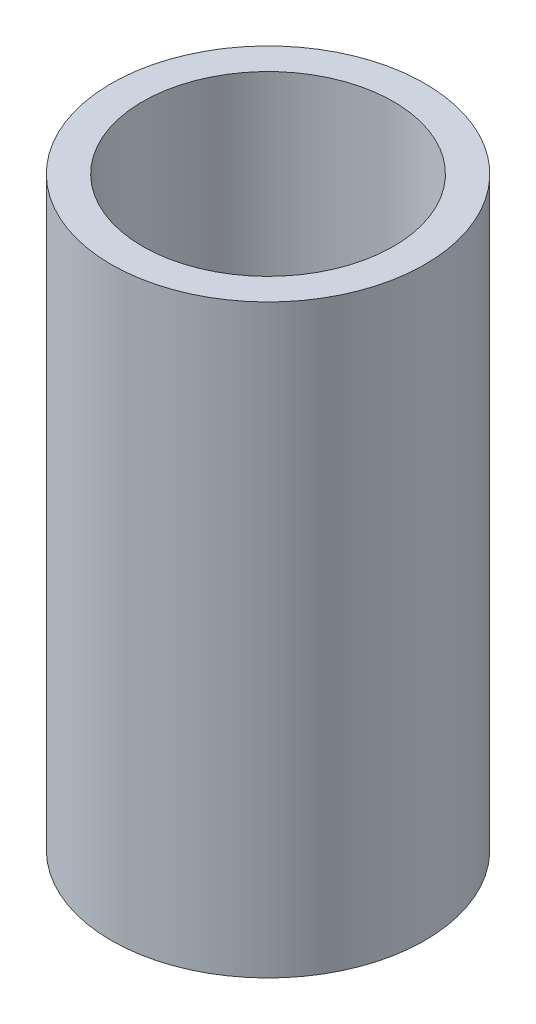
ISO-10303-21;
HEADER;
FILE_DESCRIPTION(('STEP AP214'),'2;1');
FILE_NAME('part.step','',(''),(''),'','','');
FILE_SCHEMA(('AUTOMOTIVE_DESIGN { 1 0 10303 214 1 1 1 1 }'));
ENDSEC;
DATA;
#1=APPLICATION_CONTEXT('core data for automotive mechanical design processes');
#2=APPLICATION_PROTOCOL_DEFINITION('international standard','automotive_design',2000,#1);
#3=PRODUCT_CONTEXT('',#1,'mechanical');
#4=PRODUCT('Part','Part','',(#3));
#5=PRODUCT_RELATED_PRODUCT_CATEGORY('part','',(#4));
#6=PRODUCT_DEFINITION_FORMATION('','',#4);
#7=PRODUCT_DEFINITION_CONTEXT('part definition',#1,'design');
#8=PRODUCT_DEFINITION('design','',#6,#7);
#9=PRODUCT_DEFINITION_SHAPE('','',#8);
#10=(LENGTH_UNIT() NAMED_UNIT(*) SI_UNIT(.MILLI.,.METRE.));
#11=(NAMED_UNIT(*) PLANE_ANGLE_UNIT() SI_UNIT($,.RADIAN.));
#12=(NAMED_UNIT(*) SI_UNIT($,.STERADIAN.) SOLID_ANGLE_UNIT());
#13=UNCERTAINTY_MEASURE_WITH_UNIT(LENGTH_MEASURE(1.E-05),#10,'distance_accuracy_value','');
#14=(GEOMETRIC_REPRESENTATION_CONTEXT(3) GLOBAL_UNCERTAINTY_ASSIGNED_CONTEXT((#13)) GLOBAL_UNIT_ASSIGNED_CONTEXT((#10,
#11,#12)) REPRESENTATION_CONTEXT('',''));
#15=CARTESIAN_POINT('',(0.,0.,0.));
#16=DIRECTION('',(0.,0.,1.));
#17=DIRECTION('',(1.,0.,0.));
#18=AXIS2_PLACEMENT_3D('',#15,#16,#17);
#19=CARTESIAN_POINT('',(0.,14.,0.));
#20=DIRECTION('',(0.,1.,0.));
#21=DIRECTION('',(0.,0.,1.));
#22=AXIS2_PLACEMENT_3D('',#19,#20,#21);
#23=PLANE('',#22);
#24=CARTESIAN_POINT('',(0.,14.,0.));
#25=DIRECTION('',(0.,1.,0.));
#26=DIRECTION('',(0.,0.,1.));
#27=AXIS2_PLACEMENT_3D('',#24,#25,#26);
#28=CIRCLE('',#27,7.5);
#29=CARTESIAN_POINT('',(0.,14.,7.5));
#30=VERTEX_POINT('',#29);
#31=EDGE_CURVE('E10',#30,#30,#28,.T.);
#32=ORIENTED_EDGE('',*,*,#31,.T.);
#33=EDGE_LOOP('',(#32));
#34=FACE_BOUND('',#33,.T.);
#35=CARTESIAN_POINT('',(0.,14.,0.));
#36=DIRECTION('',(0.,1.,0.));
#37=DIRECTION('',(0.,0.,1.));
#38=AXIS2_PLACEMENT_3D('',#35,#36,#37);
#39=CIRCLE('',#38,6.);
#40=CARTESIAN_POINT('',(0.,14.,6.));
#41=VERTEX_POINT('',#40);
#42=EDGE_CURVE('E50',#41,#41,#39,.T.);
#43=ORIENTED_EDGE('',*,*,#42,.F.);
#44=EDGE_LOOP('',(#43));
#45=FACE_BOUND('',#44,.T.);
#46=ADVANCED_FACE('F37',(#34,#45),#23,.T.);
#47=CARTESIAN_POINT('',(0.,-14.,0.));
#48=DIRECTION('',(0.,1.,0.));
#49=DIRECTION('',(0.,0.,1.));
#50=AXIS2_PLACEMENT_3D('',#47,#48,#49);
#51=PLANE('',#50);
#52=CARTESIAN_POINT('',(0.,-14.,0.));
#53=DIRECTION('',(0.,1.,0.));
#54=DIRECTION('',(0.,0.,1.));
#55=AXIS2_PLACEMENT_3D('',#52,#53,#54);
#56=CIRCLE('',#55,7.5);
#57=CARTESIAN_POINT('',(0.,-14.,7.5));
#58=VERTEX_POINT('',#57);
#59=EDGE_CURVE('E41',#58,#58,#56,.T.);
#60=ORIENTED_EDGE('',*,*,#59,.F.);
#61=EDGE_LOOP('',(#60));
#62=FACE_BOUND('',#61,.T.);
#63=CARTESIAN_POINT('',(0.,-14.,0.));
#64=DIRECTION('',(0.,1.,0.));
#65=DIRECTION('',(0.,0.,1.));
#66=AXIS2_PLACEMENT_3D('',#63,#64,#65);
#67=CIRCLE('',#66,6.);
#68=CARTESIAN_POINT('',(0.,-14.,6.));
#69=VERTEX_POINT('',#68);
#70=EDGE_CURVE('E52',#69,#69,#67,.T.);
#71=ORIENTED_EDGE('',*,*,#70,.T.);
#72=EDGE_LOOP('',(#71));
#73=FACE_BOUND('',#72,.T.);
#74=ADVANCED_FACE('F64',(#62,#73),#51,.F.);
#75=CARTESIAN_POINT('',(0.,14.,0.));
#76=DIRECTION('',(0.,-1.,0.));
#77=DIRECTION('',(0.,0.,-1.));
#78=AXIS2_PLACEMENT_3D('',#75,#76,#77);
#79=CYLINDRICAL_SURFACE('',#78,7.5);
#80=ORIENTED_EDGE('',*,*,#31,.F.);
#81=EDGE_LOOP('',(#80));
#82=FACE_BOUND('',#81,.T.);
#83=ORIENTED_EDGE('',*,*,#59,.T.);
#84=EDGE_LOOP('',(#83));
#85=FACE_BOUND('',#84,.T.);
#86=ADVANCED_FACE('F39',(#82,#85),#79,.T.);
#87=CARTESIAN_POINT('',(0.,14.,0.));
#88=DIRECTION('',(0.,-1.,0.));
#89=DIRECTION('',(0.,0.,-1.));
#90=AXIS2_PLACEMENT_3D('',#87,#88,#89);
#91=CYLINDRICAL_SURFACE('',#90,6.);
#92=ORIENTED_EDGE('',*,*,#42,.T.);
#93=EDGE_LOOP('',(#92));
#94=FACE_BOUND('',#93,.T.);
#95=ORIENTED_EDGE('',*,*,#70,.F.);
#96=EDGE_LOOP('',(#95));
#97=FACE_BOUND('',#96,.T.);
#98=ADVANCED_FACE('F60',(#94,#97),#91,.F.);
#99=CLOSED_SHELL('',(#46,#74,#86,#98));
#100=MANIFOLD_SOLID_BREP('B2',#99);
#101=ADVANCED_BREP_SHAPE_REPRESENTATION('',(#18,#100),#14);
#102=SHAPE_DEFINITION_REPRESENTATION(#9,#101);
ENDSEC;
END-ISO-10303-21;
